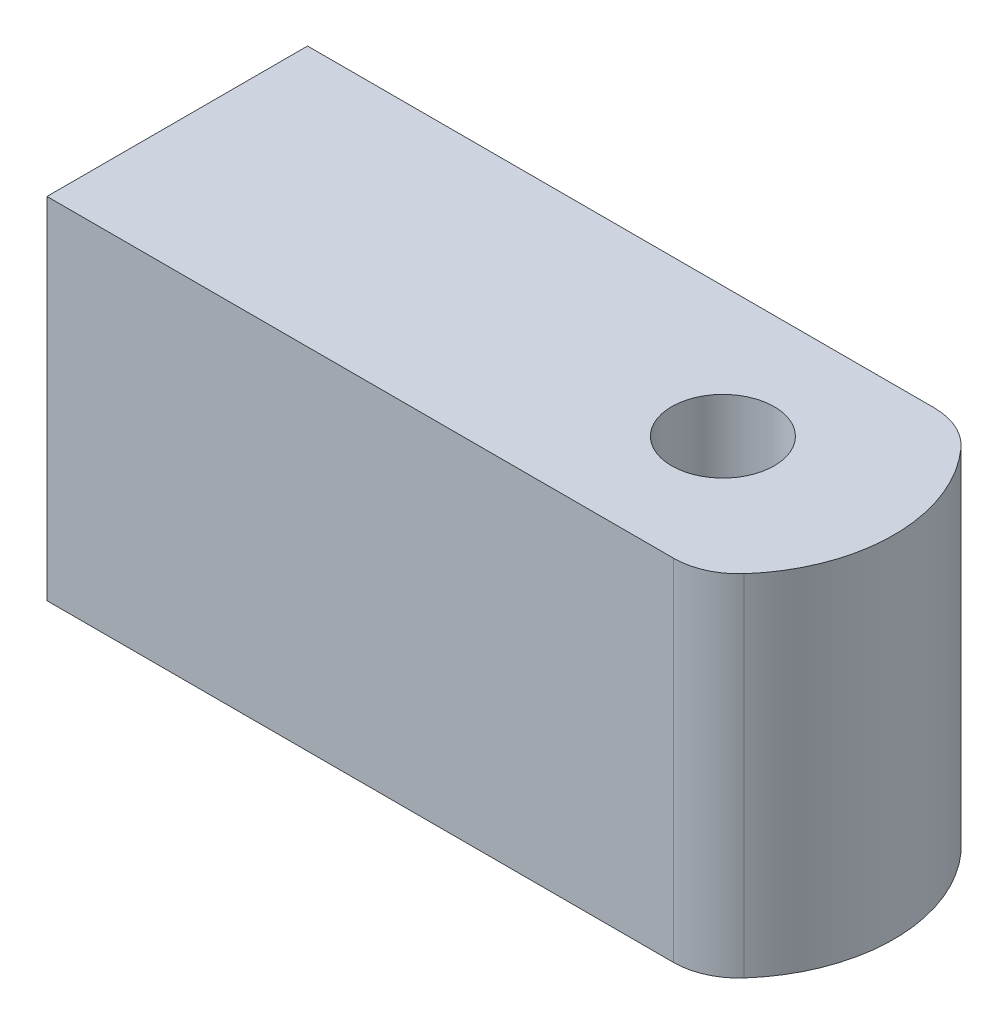
ISO-10303-21;
HEADER;
FILE_DESCRIPTION(('STEP AP214'),'2;1');
FILE_NAME('part.step','',(''),(''),'','','');
FILE_SCHEMA(('AUTOMOTIVE_DESIGN { 1 0 10303 214 1 1 1 1 }'));
ENDSEC;
DATA;
#1=APPLICATION_CONTEXT('core data for automotive mechanical design processes');
#2=APPLICATION_PROTOCOL_DEFINITION('international standard','automotive_design',2000,#1);
#3=PRODUCT_CONTEXT('',#1,'mechanical');
#4=PRODUCT('Part','Part','',(#3));
#5=PRODUCT_RELATED_PRODUCT_CATEGORY('part','',(#4));
#6=PRODUCT_DEFINITION_FORMATION('','',#4);
#7=PRODUCT_DEFINITION_CONTEXT('part definition',#1,'design');
#8=PRODUCT_DEFINITION('design','',#6,#7);
#9=PRODUCT_DEFINITION_SHAPE('','',#8);
#10=(LENGTH_UNIT() NAMED_UNIT(*) SI_UNIT(.MILLI.,.METRE.));
#11=(NAMED_UNIT(*) PLANE_ANGLE_UNIT() SI_UNIT($,.RADIAN.));
#12=(NAMED_UNIT(*) SI_UNIT($,.STERADIAN.) SOLID_ANGLE_UNIT());
#13=UNCERTAINTY_MEASURE_WITH_UNIT(LENGTH_MEASURE(1.E-05),#10,'distance_accuracy_value','');
#14=(GEOMETRIC_REPRESENTATION_CONTEXT(3) GLOBAL_UNCERTAINTY_ASSIGNED_CONTEXT((#13)) GLOBAL_UNIT_ASSIGNED_CONTEXT((#10,
#11,#12)) REPRESENTATION_CONTEXT('',''));
#15=CARTESIAN_POINT('',(0.,0.,0.));
#16=DIRECTION('',(0.,0.,1.));
#17=DIRECTION('',(1.,0.,0.));
#18=AXIS2_PLACEMENT_3D('',#15,#16,#17);
#19=CARTESIAN_POINT('',(18.5051487656619,-13.,-8.));
#20=DIRECTION('',(0.,1.,0.));
#21=DIRECTION('',(0.,0.,1.));
#22=AXIS2_PLACEMENT_3D('',#19,#20,#21);
#23=CYLINDRICAL_SURFACE('',#22,3.15);
#24=CARTESIAN_POINT('',(18.5051487656619,13.25,-8.));
#25=DIRECTION('',(0.,1.,0.));
#26=DIRECTION('',(0.,0.,1.));
#27=AXIS2_PLACEMENT_3D('',#24,#25,#26);
#28=CIRCLE('',#27,3.15);
#29=CARTESIAN_POINT('',(18.5051487656619,13.25,-4.85));
#30=VERTEX_POINT('',#29);
#31=EDGE_CURVE('E156',#30,#30,#28,.F.);
#32=ORIENTED_EDGE('',*,*,#31,.T.);
#33=EDGE_LOOP('',(#32));
#34=FACE_BOUND('',#33,.T.);
#35=CARTESIAN_POINT('',(18.5051487656619,18.75,-8.));
#36=DIRECTION('',(0.,1.,0.));
#37=DIRECTION('',(0.,0.,1.));
#38=AXIS2_PLACEMENT_3D('',#35,#36,#37);
#39=CIRCLE('',#38,3.15);
#40=CARTESIAN_POINT('',(18.5051487656619,18.75,-4.85));
#41=VERTEX_POINT('',#40);
#42=EDGE_CURVE('E369',#41,#41,#39,.F.);
#43=ORIENTED_EDGE('',*,*,#42,.F.);
#44=EDGE_LOOP('',(#43));
#45=FACE_BOUND('',#44,.T.);
#46=ADVANCED_FACE('F34',(#34,#45),#23,.F.);
#47=CARTESIAN_POINT('',(0.,-4.,0.));
#48=DIRECTION('',(0.,0.,1.));
#49=DIRECTION('',(1.,0.,0.));
#50=AXIS2_PLACEMENT_3D('',#47,#48,#49);
#51=PLANE('',#50);
#52=DIRECTION('',(0.,1.,0.));
#53=VECTOR('',#52,1.);
#54=CARTESIAN_POINT('',(-15.,-4.,0.));
#55=LINE('',#54,#53);
#56=CARTESIAN_POINT('',(-15.,-2.75,0.));
#57=VERTEX_POINT('',#56);
#58=CARTESIAN_POINT('',(-15.,18.75,0.));
#59=VERTEX_POINT('',#58);
#60=EDGE_CURVE('E128',#57,#59,#55,.T.);
#61=ORIENTED_EDGE('',*,*,#60,.F.);
#62=DIRECTION('',(-1.,0.,0.));
#63=VECTOR('',#62,1.);
#64=CARTESIAN_POINT('',(33.,-2.75,0.));
#65=LINE('',#64,#63);
#66=CARTESIAN_POINT('',(23.4772847206615,-2.75,0.));
#67=VERTEX_POINT('',#66);
#68=EDGE_CURVE('E57',#67,#57,#65,.T.);
#69=ORIENTED_EDGE('',*,*,#68,.F.);
#70=DIRECTION('',(0.,1.,0.));
#71=VECTOR('',#70,1.);
#72=CARTESIAN_POINT('',(23.4772847206615,-4.,0.));
#73=LINE('',#72,#71);
#74=CARTESIAN_POINT('',(23.4772847206615,18.75,0.));
#75=VERTEX_POINT('',#74);
#76=EDGE_CURVE('E159',#67,#75,#73,.T.);
#77=ORIENTED_EDGE('',*,*,#76,.T.);
#78=DIRECTION('',(-1.,0.,0.));
#79=VECTOR('',#78,1.);
#80=CARTESIAN_POINT('',(33.,18.75,0.));
#81=LINE('',#80,#79);
#82=EDGE_CURVE('E373',#75,#59,#81,.T.);
#83=ORIENTED_EDGE('',*,*,#82,.T.);
#84=EDGE_LOOP('',(#61,#69,#77,#83));
#85=FACE_BOUND('',#84,.T.);
#86=ADVANCED_FACE('F230',(#85),#51,.T.);
#87=CARTESIAN_POINT('',(0.,-4.,-16.));
#88=DIRECTION('',(0.,0.,-1.));
#89=DIRECTION('',(-1.,0.,0.));
#90=AXIS2_PLACEMENT_3D('',#87,#88,#89);
#91=PLANE('',#90);
#92=DIRECTION('',(0.,1.,0.));
#93=VECTOR('',#92,1.);
#94=CARTESIAN_POINT('',(23.4772847206614,-4.,-16.));
#95=LINE('',#94,#93);
#96=CARTESIAN_POINT('',(23.4772847206614,18.75,-16.));
#97=VERTEX_POINT('',#96);
#98=CARTESIAN_POINT('',(23.4772847206614,-2.75,-16.));
#99=VERTEX_POINT('',#98);
#100=EDGE_CURVE('E11',#97,#99,#95,.F.);
#101=ORIENTED_EDGE('',*,*,#100,.T.);
#102=DIRECTION('',(-1.,0.,0.));
#103=VECTOR('',#102,1.);
#104=CARTESIAN_POINT('',(33.,-2.75,-16.));
#105=LINE('',#104,#103);
#106=CARTESIAN_POINT('',(-15.,-2.75,-16.));
#107=VERTEX_POINT('',#106);
#108=EDGE_CURVE('E112',#99,#107,#105,.T.);
#109=ORIENTED_EDGE('',*,*,#108,.T.);
#110=DIRECTION('',(0.,-1.,0.));
#111=VECTOR('',#110,1.);
#112=CARTESIAN_POINT('',(-15.,19.,-16.));
#113=LINE('',#112,#111);
#114=CARTESIAN_POINT('',(-15.,18.75,-16.));
#115=VERTEX_POINT('',#114);
#116=EDGE_CURVE('E123',#115,#107,#113,.T.);
#117=ORIENTED_EDGE('',*,*,#116,.F.);
#118=DIRECTION('',(-1.,0.,0.));
#119=VECTOR('',#118,1.);
#120=CARTESIAN_POINT('',(33.,18.75,-16.));
#121=LINE('',#120,#119);
#122=EDGE_CURVE('E49',#97,#115,#121,.T.);
#123=ORIENTED_EDGE('',*,*,#122,.F.);
#124=EDGE_LOOP('',(#101,#109,#117,#123));
#125=FACE_BOUND('',#124,.T.);
#126=ADVANCED_FACE('F122',(#125),#91,.T.);
#127=CARTESIAN_POINT('',(19.0051487656619,-4.,-8.));
#128=DIRECTION('',(0.,1.,0.));
#129=DIRECTION('',(0.,0.,1.));
#130=AXIS2_PLACEMENT_3D('',#127,#128,#129);
#131=CYLINDRICAL_SURFACE('',#130,10.);
#132=DIRECTION('',(0.,1.,0.));
#133=VECTOR('',#132,1.);
#134=CARTESIAN_POINT('',(26.4587086906612,-4.,-1.33333333333334));
#135=LINE('',#134,#133);
#136=CARTESIAN_POINT('',(26.4587086906612,18.75,-1.33333333333334));
#137=VERTEX_POINT('',#136);
#138=CARTESIAN_POINT('',(26.4587086906612,-2.75,-1.33333333333334));
#139=VERTEX_POINT('',#138);
#140=EDGE_CURVE('E42',#137,#139,#135,.F.);
#141=ORIENTED_EDGE('',*,*,#140,.T.);
#142=CARTESIAN_POINT('',(19.0051487656619,-2.75,-8.));
#143=DIRECTION('',(0.,-1.,0.));
#144=DIRECTION('',(0.,0.,-1.));
#145=AXIS2_PLACEMENT_3D('',#142,#143,#144);
#146=CIRCLE('',#145,10.);
#147=CARTESIAN_POINT('',(26.4587086906612,-2.75,-14.6666666666667));
#148=VERTEX_POINT('',#147);
#149=EDGE_CURVE('E170',#139,#148,#146,.F.);
#150=ORIENTED_EDGE('',*,*,#149,.T.);
#151=DIRECTION('',(0.,1.,0.));
#152=VECTOR('',#151,1.);
#153=CARTESIAN_POINT('',(26.4587086906612,-4.,-14.6666666666667));
#154=LINE('',#153,#152);
#155=CARTESIAN_POINT('',(26.4587086906612,18.75,-14.6666666666667));
#156=VERTEX_POINT('',#155);
#157=EDGE_CURVE('E162',#148,#156,#154,.T.);
#158=ORIENTED_EDGE('',*,*,#157,.T.);
#159=CARTESIAN_POINT('',(19.0051487656619,18.75,-8.));
#160=DIRECTION('',(0.,1.,0.));
#161=DIRECTION('',(0.,0.,1.));
#162=AXIS2_PLACEMENT_3D('',#159,#160,#161);
#163=CIRCLE('',#162,10.);
#164=EDGE_CURVE('E172',#156,#137,#163,.F.);
#165=ORIENTED_EDGE('',*,*,#164,.T.);
#166=EDGE_LOOP('',(#141,#150,#158,#165));
#167=FACE_BOUND('',#166,.T.);
#168=ADVANCED_FACE('F169',(#167),#131,.T.);
#169=CARTESIAN_POINT('',(18.5051487656619,2.75,-8.));
#170=DIRECTION('',(0.,-1.,0.));
#171=DIRECTION('',(0.,0.,-1.));
#172=AXIS2_PLACEMENT_3D('',#169,#170,#171);
#173=CIRCLE('',#172,3.15);
#174=CARTESIAN_POINT('',(18.5051487656619,2.75,-11.15));
#175=VERTEX_POINT('',#174);
#176=EDGE_CURVE('E148',#175,#175,#173,.F.);
#177=ORIENTED_EDGE('',*,*,#176,.T.);
#178=EDGE_LOOP('',(#177));
#179=FACE_BOUND('',#178,.T.);
#180=CARTESIAN_POINT('',(18.5051487656619,-2.75,-8.));
#181=DIRECTION('',(0.,-1.,0.));
#182=DIRECTION('',(0.,0.,-1.));
#183=AXIS2_PLACEMENT_3D('',#180,#181,#182);
#184=CIRCLE('',#183,3.15);
#185=CARTESIAN_POINT('',(18.5051487656619,-2.75,-11.15));
#186=VERTEX_POINT('',#185);
#187=EDGE_CURVE('E180',#186,#186,#184,.F.);
#188=ORIENTED_EDGE('',*,*,#187,.F.);
#189=EDGE_LOOP('',(#188));
#190=FACE_BOUND('',#189,.T.);
#191=ADVANCED_FACE('F233',(#179,#190),#23,.F.);
#192=CARTESIAN_POINT('',(23.4772847206615,-4.,-4.));
#193=DIRECTION('',(0.,1.,0.));
#194=DIRECTION('',(0.,0.,1.));
#195=AXIS2_PLACEMENT_3D('',#192,#193,#194);
#196=CYLINDRICAL_SURFACE('',#195,4.);
#197=ORIENTED_EDGE('',*,*,#76,.F.);
#198=CARTESIAN_POINT('',(23.4772847206615,-2.75,-4.));
#199=DIRECTION('',(0.,-1.,0.));
#200=DIRECTION('',(0.,0.,-1.));
#201=AXIS2_PLACEMENT_3D('',#198,#199,#200);
#202=CIRCLE('',#201,4.);
#203=EDGE_CURVE('E179',#67,#139,#202,.F.);
#204=ORIENTED_EDGE('',*,*,#203,.T.);
#205=ORIENTED_EDGE('',*,*,#140,.F.);
#206=CARTESIAN_POINT('',(23.4772847206615,18.75,-4.));
#207=DIRECTION('',(0.,1.,0.));
#208=DIRECTION('',(0.,0.,1.));
#209=AXIS2_PLACEMENT_3D('',#206,#207,#208);
#210=CIRCLE('',#209,4.);
#211=EDGE_CURVE('E178',#137,#75,#210,.F.);
#212=ORIENTED_EDGE('',*,*,#211,.T.);
#213=EDGE_LOOP('',(#197,#204,#205,#212));
#214=FACE_BOUND('',#213,.T.);
#215=ADVANCED_FACE('F177',(#214),#196,.T.);
#216=CARTESIAN_POINT('',(23.4772847206614,-4.,-12.));
#217=DIRECTION('',(0.,1.,0.));
#218=DIRECTION('',(0.,0.,1.));
#219=AXIS2_PLACEMENT_3D('',#216,#217,#218);
#220=CYLINDRICAL_SURFACE('',#219,4.);
#221=ORIENTED_EDGE('',*,*,#157,.F.);
#222=CARTESIAN_POINT('',(23.4772847206614,-2.75,-12.));
#223=DIRECTION('',(0.,-1.,0.));
#224=DIRECTION('',(0.,0.,-1.));
#225=AXIS2_PLACEMENT_3D('',#222,#223,#224);
#226=CIRCLE('',#225,4.);
#227=EDGE_CURVE('E185',#148,#99,#226,.F.);
#228=ORIENTED_EDGE('',*,*,#227,.T.);
#229=ORIENTED_EDGE('',*,*,#100,.F.);
#230=CARTESIAN_POINT('',(23.4772847206614,18.75,-12.));
#231=DIRECTION('',(0.,1.,0.));
#232=DIRECTION('',(0.,0.,1.));
#233=AXIS2_PLACEMENT_3D('',#230,#231,#232);
#234=CIRCLE('',#233,4.);
#235=EDGE_CURVE('E361',#97,#156,#234,.F.);
#236=ORIENTED_EDGE('',*,*,#235,.T.);
#237=EDGE_LOOP('',(#221,#228,#229,#236));
#238=FACE_BOUND('',#237,.T.);
#239=ADVANCED_FACE('F36',(#238),#220,.T.);
#240=CARTESIAN_POINT('',(-15.,0.,0.));
#241=DIRECTION('',(-1.,0.,0.));
#242=DIRECTION('',(0.,0.,1.));
#243=AXIS2_PLACEMENT_3D('',#240,#241,#242);
#244=PLANE('',#243);
#245=DIRECTION('',(0.,1.,0.));
#246=VECTOR('',#245,1.);
#247=CARTESIAN_POINT('',(-15.,13.25,-2.75));
#248=LINE('',#247,#246);
#249=CARTESIAN_POINT('',(-15.,2.75,-2.75));
#250=VERTEX_POINT('',#249);
#251=CARTESIAN_POINT('',(-15.,13.25,-2.75));
#252=VERTEX_POINT('',#251);
#253=EDGE_CURVE('E191',#250,#252,#248,.T.);
#254=ORIENTED_EDGE('',*,*,#253,.F.);
#255=DIRECTION('',(0.,0.,1.));
#256=VECTOR('',#255,1.);
#257=CARTESIAN_POINT('',(-15.,2.75,-2.75));
#258=LINE('',#257,#256);
#259=CARTESIAN_POINT('',(-15.,2.75,-13.25));
#260=VERTEX_POINT('',#259);
#261=EDGE_CURVE('E183',#260,#250,#258,.T.);
#262=ORIENTED_EDGE('',*,*,#261,.F.);
#263=DIRECTION('',(0.,-1.,0.));
#264=VECTOR('',#263,1.);
#265=CARTESIAN_POINT('',(-15.,2.75,-13.25));
#266=LINE('',#265,#264);
#267=CARTESIAN_POINT('',(-15.,13.25,-13.25));
#268=VERTEX_POINT('',#267);
#269=EDGE_CURVE('E133',#268,#260,#266,.T.);
#270=ORIENTED_EDGE('',*,*,#269,.F.);
#271=DIRECTION('',(0.,0.,-1.));
#272=VECTOR('',#271,1.);
#273=CARTESIAN_POINT('',(-15.,13.25,-13.25));
#274=LINE('',#273,#272);
#275=EDGE_CURVE('E194',#252,#268,#274,.T.);
#276=ORIENTED_EDGE('',*,*,#275,.F.);
#277=EDGE_LOOP('',(#254,#262,#270,#276));
#278=FACE_BOUND('',#277,.T.);
#279=ORIENTED_EDGE('',*,*,#116,.T.);
#280=DIRECTION('',(0.,0.,1.));
#281=VECTOR('',#280,1.);
#282=CARTESIAN_POINT('',(-15.,-2.75,0.));
#283=LINE('',#282,#281);
#284=EDGE_CURVE('E108',#107,#57,#283,.T.);
#285=ORIENTED_EDGE('',*,*,#284,.T.);
#286=ORIENTED_EDGE('',*,*,#60,.T.);
#287=DIRECTION('',(0.,0.,-1.));
#288=VECTOR('',#287,1.);
#289=CARTESIAN_POINT('',(-15.,18.75,0.));
#290=LINE('',#289,#288);
#291=EDGE_CURVE('E118',#59,#115,#290,.T.);
#292=ORIENTED_EDGE('',*,*,#291,.T.);
#293=EDGE_LOOP('',(#279,#285,#286,#292));
#294=FACE_BOUND('',#293,.T.);
#295=ADVANCED_FACE('F126',(#278,#294),#244,.T.);
#296=CARTESIAN_POINT('',(24.,13.25,-13.25));
#297=DIRECTION('',(0.,1.,0.));
#298=DIRECTION('',(0.,0.,1.));
#299=AXIS2_PLACEMENT_3D('',#296,#297,#298);
#300=PLANE('',#299);
#301=DIRECTION('',(-1.,0.,0.));
#302=VECTOR('',#301,1.);
#303=CARTESIAN_POINT('',(24.,13.25,-2.75));
#304=LINE('',#303,#302);
#305=CARTESIAN_POINT('',(24.,13.25,-2.75));
#306=VERTEX_POINT('',#305);
#307=EDGE_CURVE('E149',#306,#252,#304,.T.);
#308=ORIENTED_EDGE('',*,*,#307,.T.);
#309=ORIENTED_EDGE('',*,*,#275,.T.);
#310=DIRECTION('',(-1.,0.,0.));
#311=VECTOR('',#310,1.);
#312=CARTESIAN_POINT('',(24.,13.25,-13.25));
#313=LINE('',#312,#311);
#314=CARTESIAN_POINT('',(24.,13.25,-13.25));
#315=VERTEX_POINT('',#314);
#316=EDGE_CURVE('E146',#315,#268,#313,.T.);
#317=ORIENTED_EDGE('',*,*,#316,.F.);
#318=DIRECTION('',(0.,0.,-1.));
#319=VECTOR('',#318,1.);
#320=CARTESIAN_POINT('',(24.,13.25,-13.25));
#321=LINE('',#320,#319);
#322=EDGE_CURVE('E142',#306,#315,#321,.T.);
#323=ORIENTED_EDGE('',*,*,#322,.F.);
#324=EDGE_LOOP('',(#308,#309,#317,#323));
#325=FACE_BOUND('',#324,.T.);
#326=ORIENTED_EDGE('',*,*,#31,.F.);
#327=EDGE_LOOP('',(#326));
#328=FACE_BOUND('',#327,.T.);
#329=ADVANCED_FACE('F214',(#325,#328),#300,.F.);
#330=CARTESIAN_POINT('',(24.,2.75,-2.75));
#331=DIRECTION('',(0.,-1.,0.));
#332=DIRECTION('',(0.,0.,-1.));
#333=AXIS2_PLACEMENT_3D('',#330,#331,#332);
#334=PLANE('',#333);
#335=DIRECTION('',(-1.,0.,0.));
#336=VECTOR('',#335,1.);
#337=CARTESIAN_POINT('',(24.,2.75,-13.25));
#338=LINE('',#337,#336);
#339=CARTESIAN_POINT('',(24.,2.75,-13.25));
#340=VERTEX_POINT('',#339);
#341=EDGE_CURVE('E145',#340,#260,#338,.T.);
#342=ORIENTED_EDGE('',*,*,#341,.T.);
#343=ORIENTED_EDGE('',*,*,#261,.T.);
#344=DIRECTION('',(-1.,0.,0.));
#345=VECTOR('',#344,1.);
#346=CARTESIAN_POINT('',(24.,2.75,-2.75));
#347=LINE('',#346,#345);
#348=CARTESIAN_POINT('',(24.,2.75,-2.75));
#349=VERTEX_POINT('',#348);
#350=EDGE_CURVE('E151',#349,#250,#347,.T.);
#351=ORIENTED_EDGE('',*,*,#350,.F.);
#352=DIRECTION('',(0.,0.,1.));
#353=VECTOR('',#352,1.);
#354=CARTESIAN_POINT('',(24.,2.75,-2.75));
#355=LINE('',#354,#353);
#356=EDGE_CURVE('E131',#340,#349,#355,.T.);
#357=ORIENTED_EDGE('',*,*,#356,.F.);
#358=EDGE_LOOP('',(#342,#343,#351,#357));
#359=FACE_BOUND('',#358,.T.);
#360=ORIENTED_EDGE('',*,*,#176,.F.);
#361=EDGE_LOOP('',(#360));
#362=FACE_BOUND('',#361,.T.);
#363=ADVANCED_FACE('F207',(#359,#362),#334,.F.);
#364=CARTESIAN_POINT('',(24.,2.75,-13.25));
#365=DIRECTION('',(0.,0.,-1.));
#366=DIRECTION('',(-1.,0.,0.));
#367=AXIS2_PLACEMENT_3D('',#364,#365,#366);
#368=PLANE('',#367);
#369=ORIENTED_EDGE('',*,*,#316,.T.);
#370=ORIENTED_EDGE('',*,*,#269,.T.);
#371=ORIENTED_EDGE('',*,*,#341,.F.);
#372=DIRECTION('',(0.,-1.,0.));
#373=VECTOR('',#372,1.);
#374=CARTESIAN_POINT('',(24.,2.75,-13.25));
#375=LINE('',#374,#373);
#376=EDGE_CURVE('E127',#315,#340,#375,.T.);
#377=ORIENTED_EDGE('',*,*,#376,.F.);
#378=EDGE_LOOP('',(#369,#370,#371,#377));
#379=FACE_BOUND('',#378,.T.);
#380=ADVANCED_FACE('F200',(#379),#368,.F.);
#381=CARTESIAN_POINT('',(24.,13.25,-2.75));
#382=DIRECTION('',(0.,0.,1.));
#383=DIRECTION('',(1.,0.,0.));
#384=AXIS2_PLACEMENT_3D('',#381,#382,#383);
#385=PLANE('',#384);
#386=ORIENTED_EDGE('',*,*,#350,.T.);
#387=ORIENTED_EDGE('',*,*,#253,.T.);
#388=ORIENTED_EDGE('',*,*,#307,.F.);
#389=DIRECTION('',(0.,1.,0.));
#390=VECTOR('',#389,1.);
#391=CARTESIAN_POINT('',(24.,13.25,-2.75));
#392=LINE('',#391,#390);
#393=EDGE_CURVE('E139',#349,#306,#392,.T.);
#394=ORIENTED_EDGE('',*,*,#393,.F.);
#395=EDGE_LOOP('',(#386,#387,#388,#394));
#396=FACE_BOUND('',#395,.T.);
#397=ADVANCED_FACE('F217',(#396),#385,.F.);
#398=CARTESIAN_POINT('',(24.,0.,0.));
#399=DIRECTION('',(1.,0.,0.));
#400=DIRECTION('',(0.,0.,-1.));
#401=AXIS2_PLACEMENT_3D('',#398,#399,#400);
#402=PLANE('',#401);
#403=ORIENTED_EDGE('',*,*,#376,.T.);
#404=ORIENTED_EDGE('',*,*,#356,.T.);
#405=ORIENTED_EDGE('',*,*,#393,.T.);
#406=ORIENTED_EDGE('',*,*,#322,.T.);
#407=EDGE_LOOP('',(#403,#404,#405,#406));
#408=FACE_BOUND('',#407,.T.);
#409=ADVANCED_FACE('F211',(#408),#402,.F.);
#410=CARTESIAN_POINT('',(33.,18.75,0.));
#411=DIRECTION('',(0.,1.,0.));
#412=DIRECTION('',(0.,0.,1.));
#413=AXIS2_PLACEMENT_3D('',#410,#411,#412);
#414=PLANE('',#413);
#415=ORIENTED_EDGE('',*,*,#164,.F.);
#416=ORIENTED_EDGE('',*,*,#235,.F.);
#417=ORIENTED_EDGE('',*,*,#122,.T.);
#418=ORIENTED_EDGE('',*,*,#291,.F.);
#419=ORIENTED_EDGE('',*,*,#82,.F.);
#420=ORIENTED_EDGE('',*,*,#211,.F.);
#421=EDGE_LOOP('',(#415,#416,#417,#418,#419,#420));
#422=FACE_BOUND('',#421,.T.);
#423=ORIENTED_EDGE('',*,*,#42,.T.);
#424=EDGE_LOOP('',(#423));
#425=FACE_BOUND('',#424,.T.);
#426=ADVANCED_FACE('F224',(#422,#425),#414,.T.);
#427=CARTESIAN_POINT('',(33.,-2.75,0.));
#428=DIRECTION('',(0.,-1.,0.));
#429=DIRECTION('',(0.,0.,-1.));
#430=AXIS2_PLACEMENT_3D('',#427,#428,#429);
#431=PLANE('',#430);
#432=ORIENTED_EDGE('',*,*,#68,.T.);
#433=ORIENTED_EDGE('',*,*,#284,.F.);
#434=ORIENTED_EDGE('',*,*,#108,.F.);
#435=ORIENTED_EDGE('',*,*,#227,.F.);
#436=ORIENTED_EDGE('',*,*,#149,.F.);
#437=ORIENTED_EDGE('',*,*,#203,.F.);
#438=EDGE_LOOP('',(#432,#433,#434,#435,#436,#437));
#439=FACE_BOUND('',#438,.T.);
#440=ORIENTED_EDGE('',*,*,#187,.T.);
#441=EDGE_LOOP('',(#440));
#442=FACE_BOUND('',#441,.T.);
#443=ADVANCED_FACE('F110',(#439,#442),#431,.T.);
#444=CLOSED_SHELL('',(#46,#86,#126,#168,#191,#215,#239,#295,#329,#363,#380,#397,#409,#426,#443));
#445=MANIFOLD_SOLID_BREP('B2',#444);
#446=ADVANCED_BREP_SHAPE_REPRESENTATION('',(#18,#445),#14);
#447=SHAPE_DEFINITION_REPRESENTATION(#9,#446);
ENDSEC;
END-ISO-10303-21;
